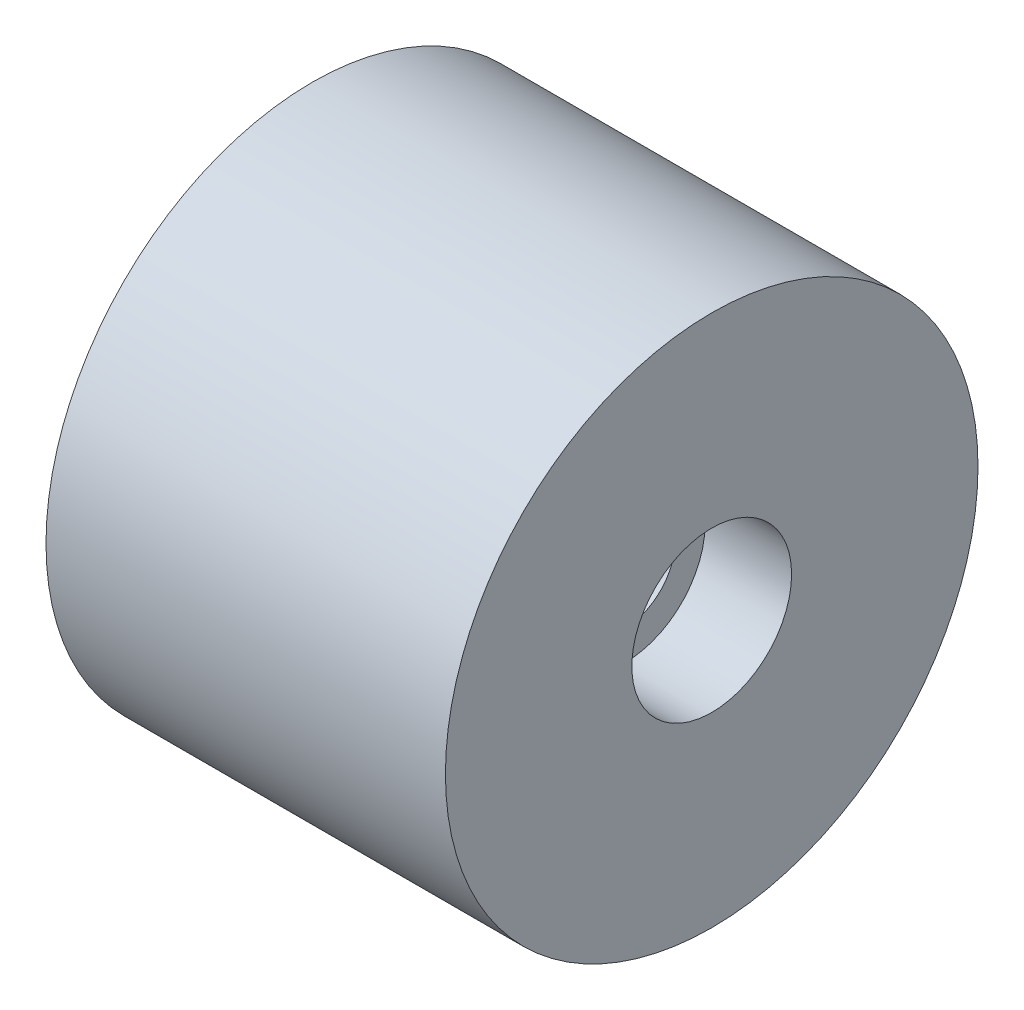
ISO-10303-21;
HEADER;
FILE_DESCRIPTION(('STEP AP214'),'2;1');
FILE_NAME('part.step','',(''),(''),'','','');
FILE_SCHEMA(('AUTOMOTIVE_DESIGN { 1 0 10303 214 1 1 1 1 }'));
ENDSEC;
DATA;
#1=APPLICATION_CONTEXT('core data for automotive mechanical design processes');
#2=APPLICATION_PROTOCOL_DEFINITION('international standard','automotive_design',2000,#1);
#3=PRODUCT_CONTEXT('',#1,'mechanical');
#4=PRODUCT('Part','Part','',(#3));
#5=PRODUCT_RELATED_PRODUCT_CATEGORY('part','',(#4));
#6=PRODUCT_DEFINITION_FORMATION('','',#4);
#7=PRODUCT_DEFINITION_CONTEXT('part definition',#1,'design');
#8=PRODUCT_DEFINITION('design','',#6,#7);
#9=PRODUCT_DEFINITION_SHAPE('','',#8);
#10=(LENGTH_UNIT() NAMED_UNIT(*) SI_UNIT(.MILLI.,.METRE.));
#11=(NAMED_UNIT(*) PLANE_ANGLE_UNIT() SI_UNIT($,.RADIAN.));
#12=(NAMED_UNIT(*) SI_UNIT($,.STERADIAN.) SOLID_ANGLE_UNIT());
#13=UNCERTAINTY_MEASURE_WITH_UNIT(LENGTH_MEASURE(1.E-05),#10,'distance_accuracy_value','');
#14=(GEOMETRIC_REPRESENTATION_CONTEXT(3) GLOBAL_UNCERTAINTY_ASSIGNED_CONTEXT((#13)) GLOBAL_UNIT_ASSIGNED_CONTEXT((#10,
#11,#12)) REPRESENTATION_CONTEXT('',''));
#15=CARTESIAN_POINT('',(0.,0.,0.));
#16=DIRECTION('',(0.,0.,1.));
#17=DIRECTION('',(1.,0.,0.));
#18=AXIS2_PLACEMENT_3D('',#15,#16,#17);
#19=CARTESIAN_POINT('',(0.,0.,0.));
#20=DIRECTION('',(1.,0.,0.));
#21=DIRECTION('',(0.,0.,-1.));
#22=AXIS2_PLACEMENT_3D('',#19,#20,#21);
#23=CYLINDRICAL_SURFACE('',#22,1.5);
#24=CARTESIAN_POINT('',(9.4,0.,0.));
#25=DIRECTION('',(1.,0.,0.));
#26=DIRECTION('',(0.,0.,-1.));
#27=AXIS2_PLACEMENT_3D('',#24,#25,#26);
#28=CIRCLE('',#27,1.5);
#29=CARTESIAN_POINT('',(9.4,0.,-1.5));
#30=VERTEX_POINT('',#29);
#31=EDGE_CURVE('E206',#30,#30,#28,.T.);
#32=ORIENTED_EDGE('',*,*,#31,.T.);
#33=EDGE_LOOP('',(#32));
#34=FACE_BOUND('',#33,.T.);
#35=CARTESIAN_POINT('',(8.,0.,0.));
#36=DIRECTION('',(-1.,0.,0.));
#37=DIRECTION('',(0.,0.,1.));
#38=AXIS2_PLACEMENT_3D('',#35,#36,#37);
#39=CIRCLE('',#38,1.5);
#40=CARTESIAN_POINT('',(8.,0.,1.5));
#41=VERTEX_POINT('',#40);
#42=EDGE_CURVE('E37',#41,#41,#39,.F.);
#43=ORIENTED_EDGE('',*,*,#42,.F.);
#44=EDGE_LOOP('',(#43));
#45=FACE_BOUND('',#44,.T.);
#46=ADVANCED_FACE('F33',(#34,#45),#23,.F.);
#47=CARTESIAN_POINT('',(12.,0.,0.));
#48=DIRECTION('',(-1.,0.,0.));
#49=DIRECTION('',(0.,0.,1.));
#50=AXIS2_PLACEMENT_3D('',#47,#48,#49);
#51=CYLINDRICAL_SURFACE('',#50,8.);
#52=CARTESIAN_POINT('',(12.,0.,0.));
#53=DIRECTION('',(1.,0.,0.));
#54=DIRECTION('',(0.,0.,-1.));
#55=AXIS2_PLACEMENT_3D('',#52,#53,#54);
#56=CIRCLE('',#55,8.);
#57=CARTESIAN_POINT('',(12.,0.,-8.));
#58=VERTEX_POINT('',#57);
#59=EDGE_CURVE('E11',#58,#58,#56,.T.);
#60=ORIENTED_EDGE('',*,*,#59,.F.);
#61=EDGE_LOOP('',(#60));
#62=FACE_BOUND('',#61,.T.);
#63=CARTESIAN_POINT('',(0.,0.,0.));
#64=DIRECTION('',(1.,0.,0.));
#65=DIRECTION('',(0.,0.,-1.));
#66=AXIS2_PLACEMENT_3D('',#63,#64,#65);
#67=CIRCLE('',#66,8.);
#68=CARTESIAN_POINT('',(0.,0.,-8.));
#69=VERTEX_POINT('',#68);
#70=EDGE_CURVE('E42',#69,#69,#67,.T.);
#71=ORIENTED_EDGE('',*,*,#70,.T.);
#72=EDGE_LOOP('',(#71));
#73=FACE_BOUND('',#72,.T.);
#74=ADVANCED_FACE('F35',(#62,#73),#51,.T.);
#75=CARTESIAN_POINT('',(12.,0.,0.));
#76=DIRECTION('',(1.,0.,0.));
#77=DIRECTION('',(0.,0.,-1.));
#78=AXIS2_PLACEMENT_3D('',#75,#76,#77);
#79=PLANE('',#78);
#80=CARTESIAN_POINT('',(12.,0.,0.));
#81=DIRECTION('',(1.,0.,0.));
#82=DIRECTION('',(0.,0.,-1.));
#83=AXIS2_PLACEMENT_3D('',#80,#81,#82);
#84=CIRCLE('',#83,2.4);
#85=CARTESIAN_POINT('',(12.,0.,-2.4));
#86=VERTEX_POINT('',#85);
#87=EDGE_CURVE('E203',#86,#86,#84,.T.);
#88=ORIENTED_EDGE('',*,*,#87,.F.);
#89=EDGE_LOOP('',(#88));
#90=FACE_BOUND('',#89,.T.);
#91=ORIENTED_EDGE('',*,*,#59,.T.);
#92=EDGE_LOOP('',(#91));
#93=FACE_BOUND('',#92,.T.);
#94=ADVANCED_FACE('F149',(#90,#93),#79,.T.);
#95=CARTESIAN_POINT('',(0.,0.,0.));
#96=DIRECTION('',(1.,0.,0.));
#97=DIRECTION('',(0.,0.,-1.));
#98=AXIS2_PLACEMENT_3D('',#95,#96,#97);
#99=PLANE('',#98);
#100=DIRECTION('',(0.,0.866025403784439,-0.5));
#101=VECTOR('',#100,1.);
#102=CARTESIAN_POINT('',(0.,0.,6.46632301492381));
#103=LINE('',#102,#101);
#104=CARTESIAN_POINT('',(0.,0.,6.46632301492381));
#105=VERTEX_POINT('',#104);
#106=CARTESIAN_POINT('',(0.,5.6,3.2331615074619));
#107=VERTEX_POINT('',#106);
#108=EDGE_CURVE('E124',#105,#107,#103,.T.);
#109=ORIENTED_EDGE('',*,*,#108,.F.);
#110=DIRECTION('',(0.,0.866025403784439,0.5));
#111=VECTOR('',#110,1.);
#112=CARTESIAN_POINT('',(0.,-5.6,3.23316150746191));
#113=LINE('',#112,#111);
#114=CARTESIAN_POINT('',(0.,-5.6,3.23316150746191));
#115=VERTEX_POINT('',#114);
#116=EDGE_CURVE('E50',#115,#105,#113,.T.);
#117=ORIENTED_EDGE('',*,*,#116,.F.);
#118=DIRECTION('',(0.,0.,1.));
#119=VECTOR('',#118,1.);
#120=CARTESIAN_POINT('',(0.,-5.6,-3.23316150746191));
#121=LINE('',#120,#119);
#122=CARTESIAN_POINT('',(0.,-5.6,-3.23316150746191));
#123=VERTEX_POINT('',#122);
#124=EDGE_CURVE('E134',#123,#115,#121,.T.);
#125=ORIENTED_EDGE('',*,*,#124,.F.);
#126=DIRECTION('',(0.,-0.866025403784439,0.5));
#127=VECTOR('',#126,1.);
#128=CARTESIAN_POINT('',(0.,0.,-6.46632301492381));
#129=LINE('',#128,#127);
#130=CARTESIAN_POINT('',(0.,0.,-6.46632301492381));
#131=VERTEX_POINT('',#130);
#132=EDGE_CURVE('E132',#131,#123,#129,.T.);
#133=ORIENTED_EDGE('',*,*,#132,.F.);
#134=DIRECTION('',(0.,-0.866025403784439,-0.5));
#135=VECTOR('',#134,1.);
#136=CARTESIAN_POINT('',(0.,5.6,-3.23316150746191));
#137=LINE('',#136,#135);
#138=CARTESIAN_POINT('',(0.,5.6,-3.23316150746191));
#139=VERTEX_POINT('',#138);
#140=EDGE_CURVE('E98',#139,#131,#137,.T.);
#141=ORIENTED_EDGE('',*,*,#140,.F.);
#142=DIRECTION('',(0.,0.,-1.));
#143=VECTOR('',#142,1.);
#144=CARTESIAN_POINT('',(0.,5.6,3.2331615074619));
#145=LINE('',#144,#143);
#146=EDGE_CURVE('E128',#107,#139,#145,.T.);
#147=ORIENTED_EDGE('',*,*,#146,.F.);
#148=EDGE_LOOP('',(#109,#117,#125,#133,#141,#147));
#149=FACE_BOUND('',#148,.T.);
#150=ORIENTED_EDGE('',*,*,#70,.F.);
#151=EDGE_LOOP('',(#150));
#152=FACE_BOUND('',#151,.T.);
#153=ADVANCED_FACE('F146',(#149,#152),#99,.F.);
#154=CARTESIAN_POINT('',(6.,-5.6,3.23316150746191));
#155=DIRECTION('',(0.,-0.5,0.866025403784439));
#156=DIRECTION('',(0.,-0.866025403784439,-0.5));
#157=AXIS2_PLACEMENT_3D('',#154,#155,#156);
#158=PLANE('',#157);
#159=ORIENTED_EDGE('',*,*,#116,.T.);
#160=DIRECTION('',(-1.,0.,0.));
#161=VECTOR('',#160,1.);
#162=CARTESIAN_POINT('',(6.,0.,6.46632301492381));
#163=LINE('',#162,#161);
#164=CARTESIAN_POINT('',(6.,0.,6.46632301492381));
#165=VERTEX_POINT('',#164);
#166=EDGE_CURVE('E80',#165,#105,#163,.T.);
#167=ORIENTED_EDGE('',*,*,#166,.F.);
#168=DIRECTION('',(0.,0.866025403784439,0.5));
#169=VECTOR('',#168,1.);
#170=CARTESIAN_POINT('',(6.,-5.6,3.23316150746191));
#171=LINE('',#170,#169);
#172=CARTESIAN_POINT('',(6.,-5.6,3.23316150746191));
#173=VERTEX_POINT('',#172);
#174=EDGE_CURVE('E136',#173,#165,#171,.T.);
#175=ORIENTED_EDGE('',*,*,#174,.F.);
#176=DIRECTION('',(-1.,0.,0.));
#177=VECTOR('',#176,1.);
#178=CARTESIAN_POINT('',(6.,-5.6,3.23316150746191));
#179=LINE('',#178,#177);
#180=EDGE_CURVE('E58',#173,#115,#179,.T.);
#181=ORIENTED_EDGE('',*,*,#180,.T.);
#182=EDGE_LOOP('',(#159,#167,#175,#181));
#183=FACE_BOUND('',#182,.T.);
#184=ADVANCED_FACE('F148',(#183),#158,.F.);
#185=CARTESIAN_POINT('',(6.,-5.6,-3.23316150746191));
#186=DIRECTION('',(0.,-1.,0.));
#187=DIRECTION('',(0.,0.,-1.));
#188=AXIS2_PLACEMENT_3D('',#185,#186,#187);
#189=PLANE('',#188);
#190=ORIENTED_EDGE('',*,*,#124,.T.);
#191=ORIENTED_EDGE('',*,*,#180,.F.);
#192=DIRECTION('',(0.,0.,1.));
#193=VECTOR('',#192,1.);
#194=CARTESIAN_POINT('',(6.,-5.6,-3.23316150746191));
#195=LINE('',#194,#193);
#196=CARTESIAN_POINT('',(6.,-5.6,-3.23316150746191));
#197=VERTEX_POINT('',#196);
#198=EDGE_CURVE('E110',#197,#173,#195,.T.);
#199=ORIENTED_EDGE('',*,*,#198,.F.);
#200=DIRECTION('',(-1.,0.,0.));
#201=VECTOR('',#200,1.);
#202=CARTESIAN_POINT('',(6.,-5.6,-3.23316150746191));
#203=LINE('',#202,#201);
#204=EDGE_CURVE('E102',#197,#123,#203,.T.);
#205=ORIENTED_EDGE('',*,*,#204,.T.);
#206=EDGE_LOOP('',(#190,#191,#199,#205));
#207=FACE_BOUND('',#206,.T.);
#208=ADVANCED_FACE('F155',(#207),#189,.F.);
#209=CARTESIAN_POINT('',(6.,0.,-6.46632301492381));
#210=DIRECTION('',(0.,-0.5,-0.866025403784439));
#211=DIRECTION('',(0.,0.866025403784439,-0.5));
#212=AXIS2_PLACEMENT_3D('',#209,#210,#211);
#213=PLANE('',#212);
#214=ORIENTED_EDGE('',*,*,#132,.T.);
#215=ORIENTED_EDGE('',*,*,#204,.F.);
#216=DIRECTION('',(0.,-0.866025403784439,0.5));
#217=VECTOR('',#216,1.);
#218=CARTESIAN_POINT('',(6.,0.,-6.46632301492381));
#219=LINE('',#218,#217);
#220=CARTESIAN_POINT('',(6.,0.,-6.46632301492381));
#221=VERTEX_POINT('',#220);
#222=EDGE_CURVE('E106',#221,#197,#219,.T.);
#223=ORIENTED_EDGE('',*,*,#222,.F.);
#224=DIRECTION('',(-1.,0.,0.));
#225=VECTOR('',#224,1.);
#226=CARTESIAN_POINT('',(6.,0.,-6.46632301492381));
#227=LINE('',#226,#225);
#228=EDGE_CURVE('E91',#221,#131,#227,.T.);
#229=ORIENTED_EDGE('',*,*,#228,.T.);
#230=EDGE_LOOP('',(#214,#215,#223,#229));
#231=FACE_BOUND('',#230,.T.);
#232=ADVANCED_FACE('F107',(#231),#213,.F.);
#233=CARTESIAN_POINT('',(6.,5.6,-3.23316150746191));
#234=DIRECTION('',(0.,0.5,-0.866025403784439));
#235=DIRECTION('',(0.,0.866025403784439,0.5));
#236=AXIS2_PLACEMENT_3D('',#233,#234,#235);
#237=PLANE('',#236);
#238=ORIENTED_EDGE('',*,*,#140,.T.);
#239=ORIENTED_EDGE('',*,*,#228,.F.);
#240=DIRECTION('',(0.,-0.866025403784439,-0.5));
#241=VECTOR('',#240,1.);
#242=CARTESIAN_POINT('',(6.,5.6,-3.23316150746191));
#243=LINE('',#242,#241);
#244=CARTESIAN_POINT('',(6.,5.6,-3.23316150746191));
#245=VERTEX_POINT('',#244);
#246=EDGE_CURVE('E95',#245,#221,#243,.T.);
#247=ORIENTED_EDGE('',*,*,#246,.F.);
#248=DIRECTION('',(-1.,0.,0.));
#249=VECTOR('',#248,1.);
#250=CARTESIAN_POINT('',(6.,5.6,-3.23316150746191));
#251=LINE('',#250,#249);
#252=EDGE_CURVE('E103',#245,#139,#251,.T.);
#253=ORIENTED_EDGE('',*,*,#252,.T.);
#254=EDGE_LOOP('',(#238,#239,#247,#253));
#255=FACE_BOUND('',#254,.T.);
#256=ADVANCED_FACE('F93',(#255),#237,.F.);
#257=CARTESIAN_POINT('',(6.,5.6,3.2331615074619));
#258=DIRECTION('',(0.,1.,0.));
#259=DIRECTION('',(0.,0.,1.));
#260=AXIS2_PLACEMENT_3D('',#257,#258,#259);
#261=PLANE('',#260);
#262=ORIENTED_EDGE('',*,*,#146,.T.);
#263=ORIENTED_EDGE('',*,*,#252,.F.);
#264=DIRECTION('',(0.,0.,-1.));
#265=VECTOR('',#264,1.);
#266=CARTESIAN_POINT('',(6.,5.6,3.2331615074619));
#267=LINE('',#266,#265);
#268=CARTESIAN_POINT('',(6.,5.6,3.2331615074619));
#269=VERTEX_POINT('',#268);
#270=EDGE_CURVE('E116',#269,#245,#267,.T.);
#271=ORIENTED_EDGE('',*,*,#270,.F.);
#272=DIRECTION('',(-1.,0.,0.));
#273=VECTOR('',#272,1.);
#274=CARTESIAN_POINT('',(6.,5.6,3.2331615074619));
#275=LINE('',#274,#273);
#276=EDGE_CURVE('E140',#269,#107,#275,.T.);
#277=ORIENTED_EDGE('',*,*,#276,.T.);
#278=EDGE_LOOP('',(#262,#263,#271,#277));
#279=FACE_BOUND('',#278,.T.);
#280=ADVANCED_FACE('F192',(#279),#261,.F.);
#281=CARTESIAN_POINT('',(6.,0.,6.46632301492381));
#282=DIRECTION('',(0.,0.5,0.866025403784439));
#283=DIRECTION('',(0.,-0.866025403784439,0.5));
#284=AXIS2_PLACEMENT_3D('',#281,#282,#283);
#285=PLANE('',#284);
#286=ORIENTED_EDGE('',*,*,#108,.T.);
#287=ORIENTED_EDGE('',*,*,#276,.F.);
#288=DIRECTION('',(0.,0.866025403784439,-0.5));
#289=VECTOR('',#288,1.);
#290=CARTESIAN_POINT('',(6.,0.,6.46632301492381));
#291=LINE('',#290,#289);
#292=EDGE_CURVE('E118',#165,#269,#291,.T.);
#293=ORIENTED_EDGE('',*,*,#292,.F.);
#294=ORIENTED_EDGE('',*,*,#166,.T.);
#295=EDGE_LOOP('',(#286,#287,#293,#294));
#296=FACE_BOUND('',#295,.T.);
#297=ADVANCED_FACE('F184',(#296),#285,.F.);
#298=CARTESIAN_POINT('',(6.,0.,0.));
#299=DIRECTION('',(-1.,0.,0.));
#300=DIRECTION('',(0.,0.,1.));
#301=AXIS2_PLACEMENT_3D('',#298,#299,#300);
#302=PLANE('',#301);
#303=CARTESIAN_POINT('',(6.,0.,0.));
#304=DIRECTION('',(-1.,0.,0.));
#305=DIRECTION('',(0.,0.,1.));
#306=AXIS2_PLACEMENT_3D('',#303,#304,#305);
#307=CIRCLE('',#306,3.);
#308=CARTESIAN_POINT('',(6.,0.,3.));
#309=VERTEX_POINT('',#308);
#310=EDGE_CURVE('E210',#309,#309,#307,.T.);
#311=ORIENTED_EDGE('',*,*,#310,.F.);
#312=EDGE_LOOP('',(#311));
#313=FACE_BOUND('',#312,.T.);
#314=ORIENTED_EDGE('',*,*,#174,.T.);
#315=ORIENTED_EDGE('',*,*,#292,.T.);
#316=ORIENTED_EDGE('',*,*,#270,.T.);
#317=ORIENTED_EDGE('',*,*,#246,.T.);
#318=ORIENTED_EDGE('',*,*,#222,.T.);
#319=ORIENTED_EDGE('',*,*,#198,.T.);
#320=EDGE_LOOP('',(#314,#315,#316,#317,#318,#319));
#321=FACE_BOUND('',#320,.T.);
#322=ADVANCED_FACE('F113',(#313,#321),#302,.T.);
#323=CARTESIAN_POINT('',(9.4,0.,0.));
#324=DIRECTION('',(1.,0.,0.));
#325=DIRECTION('',(0.,0.,-1.));
#326=AXIS2_PLACEMENT_3D('',#323,#324,#325);
#327=CYLINDRICAL_SURFACE('',#326,2.4);
#328=CARTESIAN_POINT('',(9.4,0.,0.));
#329=DIRECTION('',(1.,0.,0.));
#330=DIRECTION('',(0.,0.,-1.));
#331=AXIS2_PLACEMENT_3D('',#328,#329,#330);
#332=CIRCLE('',#331,2.4);
#333=CARTESIAN_POINT('',(9.4,0.,-2.4));
#334=VERTEX_POINT('',#333);
#335=EDGE_CURVE('E125',#334,#334,#332,.T.);
#336=ORIENTED_EDGE('',*,*,#335,.F.);
#337=EDGE_LOOP('',(#336));
#338=FACE_BOUND('',#337,.T.);
#339=ORIENTED_EDGE('',*,*,#87,.T.);
#340=EDGE_LOOP('',(#339));
#341=FACE_BOUND('',#340,.T.);
#342=ADVANCED_FACE('F177',(#338,#341),#327,.F.);
#343=CARTESIAN_POINT('',(9.4,0.,0.));
#344=DIRECTION('',(1.,0.,0.));
#345=DIRECTION('',(0.,0.,-1.));
#346=AXIS2_PLACEMENT_3D('',#343,#344,#345);
#347=PLANE('',#346);
#348=ORIENTED_EDGE('',*,*,#31,.F.);
#349=EDGE_LOOP('',(#348));
#350=FACE_BOUND('',#349,.T.);
#351=ORIENTED_EDGE('',*,*,#335,.T.);
#352=EDGE_LOOP('',(#351));
#353=FACE_BOUND('',#352,.T.);
#354=ADVANCED_FACE('F173',(#350,#353),#347,.T.);
#355=CARTESIAN_POINT('',(8.,0.,0.));
#356=DIRECTION('',(-1.,0.,0.));
#357=DIRECTION('',(0.,0.,1.));
#358=AXIS2_PLACEMENT_3D('',#355,#356,#357);
#359=PLANE('',#358);
#360=CARTESIAN_POINT('',(8.,0.,0.));
#361=DIRECTION('',(-1.,0.,0.));
#362=DIRECTION('',(0.,0.,1.));
#363=AXIS2_PLACEMENT_3D('',#360,#361,#362);
#364=CIRCLE('',#363,3.);
#365=CARTESIAN_POINT('',(8.,0.,3.));
#366=VERTEX_POINT('',#365);
#367=EDGE_CURVE('E213',#366,#366,#364,.T.);
#368=ORIENTED_EDGE('',*,*,#367,.T.);
#369=EDGE_LOOP('',(#368));
#370=FACE_BOUND('',#369,.T.);
#371=ORIENTED_EDGE('',*,*,#42,.T.);
#372=EDGE_LOOP('',(#371));
#373=FACE_BOUND('',#372,.T.);
#374=ADVANCED_FACE('F176',(#370,#373),#359,.T.);
#375=CARTESIAN_POINT('',(8.,0.,0.));
#376=DIRECTION('',(-1.,0.,0.));
#377=DIRECTION('',(0.,0.,1.));
#378=AXIS2_PLACEMENT_3D('',#375,#376,#377);
#379=CYLINDRICAL_SURFACE('',#378,3.);
#380=ORIENTED_EDGE('',*,*,#367,.F.);
#381=EDGE_LOOP('',(#380));
#382=FACE_BOUND('',#381,.T.);
#383=ORIENTED_EDGE('',*,*,#310,.T.);
#384=EDGE_LOOP('',(#383));
#385=FACE_BOUND('',#384,.T.);
#386=ADVANCED_FACE('F171',(#382,#385),#379,.F.);
#387=CLOSED_SHELL('',(#46,#74,#94,#153,#184,#208,#232,#256,#280,#297,#322,#342,#354,#374,#386));
#388=MANIFOLD_SOLID_BREP('B2',#387);
#389=ADVANCED_BREP_SHAPE_REPRESENTATION('',(#18,#388),#14);
#390=SHAPE_DEFINITION_REPRESENTATION(#9,#389);
ENDSEC;
END-ISO-10303-21;
